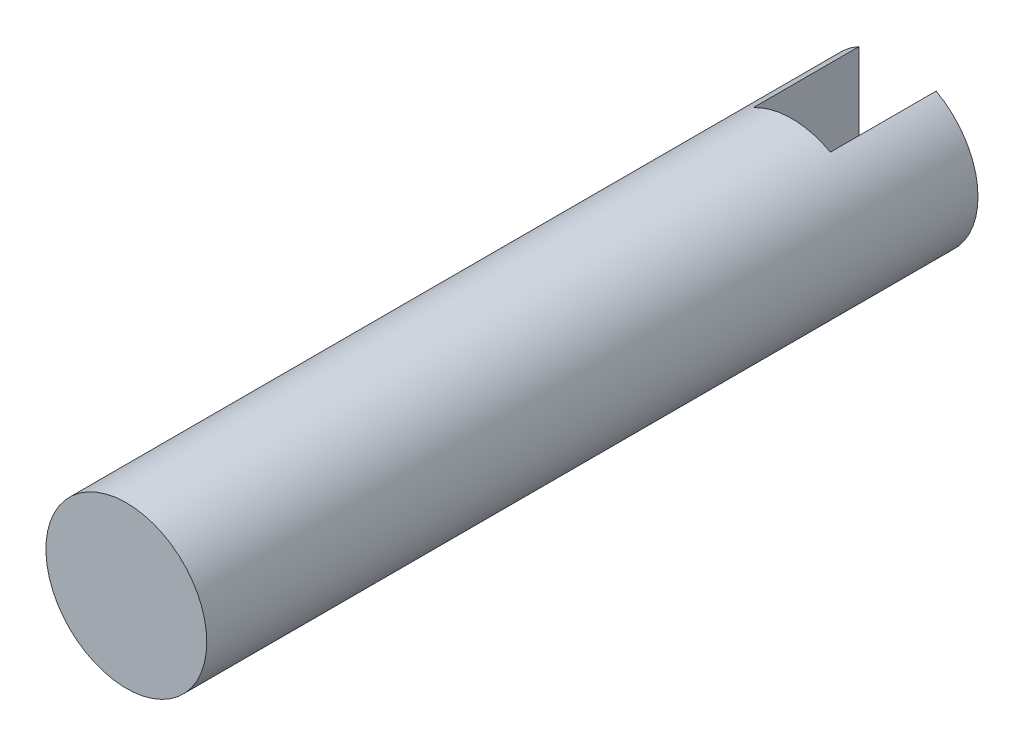
ISO-10303-21;
HEADER;
FILE_DESCRIPTION(('STEP AP214'),'2;1');
FILE_NAME('part.step','',(''),(''),'','','');
FILE_SCHEMA(('AUTOMOTIVE_DESIGN { 1 0 10303 214 1 1 1 1 }'));
ENDSEC;
DATA;
#1=APPLICATION_CONTEXT('core data for automotive mechanical design processes');
#2=APPLICATION_PROTOCOL_DEFINITION('international standard','automotive_design',2000,#1);
#3=PRODUCT_CONTEXT('',#1,'mechanical');
#4=PRODUCT('Part','Part','',(#3));
#5=PRODUCT_RELATED_PRODUCT_CATEGORY('part','',(#4));
#6=PRODUCT_DEFINITION_FORMATION('','',#4);
#7=PRODUCT_DEFINITION_CONTEXT('part definition',#1,'design');
#8=PRODUCT_DEFINITION('design','',#6,#7);
#9=PRODUCT_DEFINITION_SHAPE('','',#8);
#10=(LENGTH_UNIT() NAMED_UNIT(*) SI_UNIT(.MILLI.,.METRE.));
#11=(NAMED_UNIT(*) PLANE_ANGLE_UNIT() SI_UNIT($,.RADIAN.));
#12=(NAMED_UNIT(*) SI_UNIT($,.STERADIAN.) SOLID_ANGLE_UNIT());
#13=UNCERTAINTY_MEASURE_WITH_UNIT(LENGTH_MEASURE(1.E-05),#10,'distance_accuracy_value','');
#14=(GEOMETRIC_REPRESENTATION_CONTEXT(3) GLOBAL_UNCERTAINTY_ASSIGNED_CONTEXT((#13)) GLOBAL_UNIT_ASSIGNED_CONTEXT((#10,
#11,#12)) REPRESENTATION_CONTEXT('',''));
#15=CARTESIAN_POINT('',(0.,0.,0.));
#16=DIRECTION('',(0.,0.,1.));
#17=DIRECTION('',(1.,0.,0.));
#18=AXIS2_PLACEMENT_3D('',#15,#16,#17);
#19=CARTESIAN_POINT('',(0.,0.,35.));
#20=DIRECTION('',(0.,0.,-1.));
#21=DIRECTION('',(-1.,0.,0.));
#22=AXIS2_PLACEMENT_3D('',#19,#20,#21);
#23=CYLINDRICAL_SURFACE('',#22,3.65);
#24=CARTESIAN_POINT('',(0.,0.,35.));
#25=DIRECTION('',(0.,0.,1.));
#26=DIRECTION('',(1.,0.,0.));
#27=AXIS2_PLACEMENT_3D('',#24,#25,#26);
#28=CIRCLE('',#27,3.65);
#29=CARTESIAN_POINT('',(3.65,0.,35.));
#30=VERTEX_POINT('',#29);
#31=EDGE_CURVE('E79',#30,#30,#28,.T.);
#32=ORIENTED_EDGE('',*,*,#31,.F.);
#33=EDGE_LOOP('',(#32));
#34=FACE_BOUND('',#33,.T.);
#35=DIRECTION('',(0.,0.,-1.));
#36=VECTOR('',#35,1.);
#37=CARTESIAN_POINT('',(-1.75,3.20312347560939,35.));
#38=LINE('',#37,#36);
#39=CARTESIAN_POINT('',(-1.75,3.20312347560939,0.));
#40=VERTEX_POINT('',#39);
#41=CARTESIAN_POINT('',(-1.75,3.20312347560939,4.8));
#42=VERTEX_POINT('',#41);
#43=EDGE_CURVE('E85',#40,#42,#38,.F.);
#44=ORIENTED_EDGE('',*,*,#43,.F.);
#45=CARTESIAN_POINT('',(0.,0.,0.));
#46=DIRECTION('',(0.,0.,1.));
#47=DIRECTION('',(1.,0.,0.));
#48=AXIS2_PLACEMENT_3D('',#45,#46,#47);
#49=CIRCLE('',#48,3.65);
#50=CARTESIAN_POINT('',(-1.75,-3.20312347560939,0.));
#51=VERTEX_POINT('',#50);
#52=EDGE_CURVE('E88',#40,#51,#49,.T.);
#53=ORIENTED_EDGE('',*,*,#52,.T.);
#54=DIRECTION('',(0.,0.,-1.));
#55=VECTOR('',#54,1.);
#56=CARTESIAN_POINT('',(-1.75,-3.20312347560939,35.));
#57=LINE('',#56,#55);
#58=CARTESIAN_POINT('',(-1.75,-3.20312347560939,4.8));
#59=VERTEX_POINT('',#58);
#60=EDGE_CURVE('E89',#59,#51,#57,.T.);
#61=ORIENTED_EDGE('',*,*,#60,.F.);
#62=CARTESIAN_POINT('',(0.,0.,4.8));
#63=DIRECTION('',(0.,0.,-1.));
#64=DIRECTION('',(-1.,0.,0.));
#65=AXIS2_PLACEMENT_3D('',#62,#63,#64);
#66=CIRCLE('',#65,3.65);
#67=CARTESIAN_POINT('',(1.75,-3.20312347560939,4.8));
#68=VERTEX_POINT('',#67);
#69=EDGE_CURVE('E36',#68,#59,#66,.T.);
#70=ORIENTED_EDGE('',*,*,#69,.F.);
#71=DIRECTION('',(0.,0.,-1.));
#72=VECTOR('',#71,1.);
#73=CARTESIAN_POINT('',(1.75,-3.20312347560939,35.));
#74=LINE('',#73,#72);
#75=CARTESIAN_POINT('',(1.75,-3.20312347560939,0.));
#76=VERTEX_POINT('',#75);
#77=EDGE_CURVE('E74',#68,#76,#74,.T.);
#78=ORIENTED_EDGE('',*,*,#77,.T.);
#79=CARTESIAN_POINT('',(1.75,3.20312347560939,0.));
#80=VERTEX_POINT('',#79);
#81=EDGE_CURVE('E83',#76,#80,#49,.T.);
#82=ORIENTED_EDGE('',*,*,#81,.T.);
#83=DIRECTION('',(0.,0.,-1.));
#84=VECTOR('',#83,1.);
#85=CARTESIAN_POINT('',(1.75,3.20312347560939,35.));
#86=LINE('',#85,#84);
#87=CARTESIAN_POINT('',(1.75,3.20312347560939,4.8));
#88=VERTEX_POINT('',#87);
#89=EDGE_CURVE('E47',#80,#88,#86,.F.);
#90=ORIENTED_EDGE('',*,*,#89,.T.);
#91=EDGE_CURVE('E11',#42,#88,#66,.T.);
#92=ORIENTED_EDGE('',*,*,#91,.F.);
#93=EDGE_LOOP('',(#44,#53,#61,#70,#78,#82,#90,#92));
#94=FACE_BOUND('',#93,.T.);
#95=ADVANCED_FACE('F33',(#34,#94),#23,.T.);
#96=CARTESIAN_POINT('',(0.,0.,0.));
#97=DIRECTION('',(0.,0.,1.));
#98=DIRECTION('',(1.,0.,0.));
#99=AXIS2_PLACEMENT_3D('',#96,#97,#98);
#100=PLANE('',#99);
#101=DIRECTION('',(0.,1.,0.));
#102=VECTOR('',#101,1.);
#103=CARTESIAN_POINT('',(-1.75,0.,0.));
#104=LINE('',#103,#102);
#105=EDGE_CURVE('E78',#51,#40,#104,.T.);
#106=ORIENTED_EDGE('',*,*,#105,.F.);
#107=ORIENTED_EDGE('',*,*,#52,.F.);
#108=EDGE_LOOP('',(#106,#107));
#109=FACE_BOUND('',#108,.T.);
#110=ADVANCED_FACE('F101',(#109),#100,.F.);
#111=CARTESIAN_POINT('',(0.,0.,35.));
#112=DIRECTION('',(0.,0.,1.));
#113=DIRECTION('',(1.,0.,0.));
#114=AXIS2_PLACEMENT_3D('',#111,#112,#113);
#115=PLANE('',#114);
#116=ORIENTED_EDGE('',*,*,#31,.T.);
#117=EDGE_LOOP('',(#116));
#118=FACE_BOUND('',#117,.T.);
#119=ADVANCED_FACE('F103',(#118),#115,.T.);
#120=ORIENTED_EDGE('',*,*,#81,.F.);
#121=DIRECTION('',(0.,1.,0.));
#122=VECTOR('',#121,1.);
#123=CARTESIAN_POINT('',(1.75,0.,0.));
#124=LINE('',#123,#122);
#125=EDGE_CURVE('E71',#76,#80,#124,.T.);
#126=ORIENTED_EDGE('',*,*,#125,.T.);
#127=EDGE_LOOP('',(#120,#126));
#128=FACE_BOUND('',#127,.T.);
#129=ADVANCED_FACE('F87',(#128),#100,.F.);
#130=CARTESIAN_POINT('',(0.,-4.,4.8));
#131=DIRECTION('',(0.,0.,-1.));
#132=DIRECTION('',(-1.,0.,0.));
#133=AXIS2_PLACEMENT_3D('',#130,#131,#132);
#134=PLANE('',#133);
#135=ORIENTED_EDGE('',*,*,#91,.T.);
#136=DIRECTION('',(0.,-1.,0.));
#137=VECTOR('',#136,1.);
#138=CARTESIAN_POINT('',(1.75,4.,4.8));
#139=LINE('',#138,#137);
#140=EDGE_CURVE('E159',#88,#68,#139,.T.);
#141=ORIENTED_EDGE('',*,*,#140,.T.);
#142=ORIENTED_EDGE('',*,*,#69,.T.);
#143=DIRECTION('',(0.,-1.,0.));
#144=VECTOR('',#143,1.);
#145=CARTESIAN_POINT('',(-1.75,4.,4.8));
#146=LINE('',#145,#144);
#147=EDGE_CURVE('E160',#42,#59,#146,.T.);
#148=ORIENTED_EDGE('',*,*,#147,.F.);
#149=EDGE_LOOP('',(#135,#141,#142,#148));
#150=FACE_BOUND('',#149,.T.);
#151=ADVANCED_FACE('F112',(#150),#134,.T.);
#152=CARTESIAN_POINT('',(-1.75,4.,4.8));
#153=DIRECTION('',(1.,0.,0.));
#154=DIRECTION('',(0.,1.,0.));
#155=AXIS2_PLACEMENT_3D('',#152,#153,#154);
#156=PLANE('',#155);
#157=ORIENTED_EDGE('',*,*,#60,.T.);
#158=ORIENTED_EDGE('',*,*,#105,.T.);
#159=ORIENTED_EDGE('',*,*,#43,.T.);
#160=ORIENTED_EDGE('',*,*,#147,.T.);
#161=EDGE_LOOP('',(#157,#158,#159,#160));
#162=FACE_BOUND('',#161,.T.);
#163=ADVANCED_FACE('F96',(#162),#156,.T.);
#164=CARTESIAN_POINT('',(1.75,4.,4.8));
#165=DIRECTION('',(1.,0.,0.));
#166=DIRECTION('',(0.,1.,0.));
#167=AXIS2_PLACEMENT_3D('',#164,#165,#166);
#168=PLANE('',#167);
#169=ORIENTED_EDGE('',*,*,#140,.F.);
#170=ORIENTED_EDGE('',*,*,#89,.F.);
#171=ORIENTED_EDGE('',*,*,#125,.F.);
#172=ORIENTED_EDGE('',*,*,#77,.F.);
#173=EDGE_LOOP('',(#169,#170,#171,#172));
#174=FACE_BOUND('',#173,.T.);
#175=ADVANCED_FACE('F73',(#174),#168,.F.);
#176=CLOSED_SHELL('',(#95,#110,#119,#129,#151,#163,#175));
#177=MANIFOLD_SOLID_BREP('B2',#176);
#178=ADVANCED_BREP_SHAPE_REPRESENTATION('',(#18,#177),#14);
#179=SHAPE_DEFINITION_REPRESENTATION(#9,#178);
ENDSEC;
END-ISO-10303-21;
